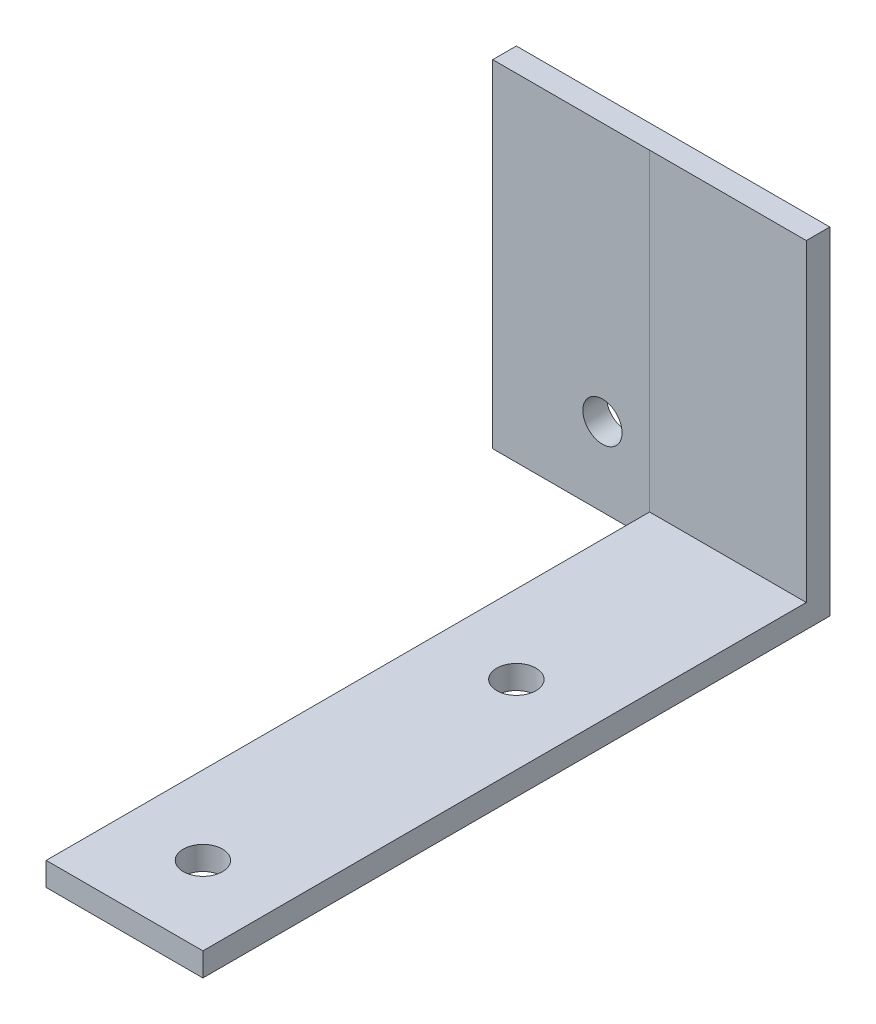
ISO-10303-21;
HEADER;
FILE_DESCRIPTION(('STEP AP214'),'2;1');
FILE_NAME('part.step','',(''),(''),'','','');
FILE_SCHEMA(('AUTOMOTIVE_DESIGN { 1 0 10303 214 1 1 1 1 }'));
ENDSEC;
DATA;
#1=APPLICATION_CONTEXT('core data for automotive mechanical design processes');
#2=APPLICATION_PROTOCOL_DEFINITION('international standard','automotive_design',2000,#1);
#3=PRODUCT_CONTEXT('',#1,'mechanical');
#4=PRODUCT('Part','Part','',(#3));
#5=PRODUCT_RELATED_PRODUCT_CATEGORY('part','',(#4));
#6=PRODUCT_DEFINITION_FORMATION('','',#4);
#7=PRODUCT_DEFINITION_CONTEXT('part definition',#1,'design');
#8=PRODUCT_DEFINITION('design','',#6,#7);
#9=PRODUCT_DEFINITION_SHAPE('','',#8);
#10=(LENGTH_UNIT() NAMED_UNIT(*) SI_UNIT(.MILLI.,.METRE.));
#11=(NAMED_UNIT(*) PLANE_ANGLE_UNIT() SI_UNIT($,.RADIAN.));
#12=(NAMED_UNIT(*) SI_UNIT($,.STERADIAN.) SOLID_ANGLE_UNIT());
#13=UNCERTAINTY_MEASURE_WITH_UNIT(LENGTH_MEASURE(1.E-05),#10,'distance_accuracy_value','');
#14=(GEOMETRIC_REPRESENTATION_CONTEXT(3) GLOBAL_UNCERTAINTY_ASSIGNED_CONTEXT((#13)) GLOBAL_UNIT_ASSIGNED_CONTEXT((#10,
#11,#12)) REPRESENTATION_CONTEXT('',''));
#15=CARTESIAN_POINT('',(0.,0.,0.));
#16=DIRECTION('',(0.,0.,1.));
#17=DIRECTION('',(1.,0.,0.));
#18=AXIS2_PLACEMENT_3D('',#15,#16,#17);
#19=CARTESIAN_POINT('',(-10.,3.,-40.));
#20=DIRECTION('',(1.,0.,0.));
#21=DIRECTION('',(0.,0.,-1.));
#22=AXIS2_PLACEMENT_3D('',#19,#20,#21);
#23=PLANE('',#22);
#24=DIRECTION('',(0.,1.,0.));
#25=VECTOR('',#24,1.);
#26=CARTESIAN_POINT('',(-10.,43.,-36.9846765094458));
#27=LINE('',#26,#25);
#28=CARTESIAN_POINT('',(-10.,0.,-36.9846765094458));
#29=VERTEX_POINT('',#28);
#30=CARTESIAN_POINT('',(-10.,3.,-36.9846765094458));
#31=VERTEX_POINT('',#30);
#32=EDGE_CURVE('E60',#29,#31,#27,.T.);
#33=ORIENTED_EDGE('',*,*,#32,.F.);
#34=DIRECTION('',(0.,0.,1.));
#35=VECTOR('',#34,1.);
#36=CARTESIAN_POINT('',(-10.,0.,-40.));
#37=LINE('',#36,#35);
#38=CARTESIAN_POINT('',(-9.99999999999999,0.,40.));
#39=VERTEX_POINT('',#38);
#40=EDGE_CURVE('E123',#29,#39,#37,.T.);
#41=ORIENTED_EDGE('',*,*,#40,.T.);
#42=DIRECTION('',(0.,-1.,0.));
#43=VECTOR('',#42,1.);
#44=CARTESIAN_POINT('',(-9.99999999999999,3.,40.));
#45=LINE('',#44,#43);
#46=CARTESIAN_POINT('',(-9.99999999999999,3.,40.));
#47=VERTEX_POINT('',#46);
#48=EDGE_CURVE('E53',#47,#39,#45,.T.);
#49=ORIENTED_EDGE('',*,*,#48,.F.);
#50=DIRECTION('',(0.,0.,1.));
#51=VECTOR('',#50,1.);
#52=CARTESIAN_POINT('',(-10.,3.,-40.));
#53=LINE('',#52,#51);
#54=EDGE_CURVE('E201',#31,#47,#53,.T.);
#55=ORIENTED_EDGE('',*,*,#54,.F.);
#56=EDGE_LOOP('',(#33,#41,#49,#55));
#57=FACE_BOUND('',#56,.T.);
#58=ADVANCED_FACE('F43',(#57),#23,.F.);
#59=CARTESIAN_POINT('',(0.,3.,0.));
#60=DIRECTION('',(0.,1.,0.));
#61=DIRECTION('',(0.,0.,1.));
#62=AXIS2_PLACEMENT_3D('',#59,#60,#61);
#63=PLANE('',#62);
#64=DIRECTION('',(1.,0.,0.));
#65=VECTOR('',#64,1.);
#66=CARTESIAN_POINT('',(-10.,3.,-37.));
#67=LINE('',#66,#65);
#68=CARTESIAN_POINT('',(-10.,3.,-37.));
#69=VERTEX_POINT('',#68);
#70=CARTESIAN_POINT('',(10.,3.,-37.));
#71=VERTEX_POINT('',#70);
#72=EDGE_CURVE('E68',#69,#71,#67,.T.);
#73=ORIENTED_EDGE('',*,*,#72,.F.);
#74=EDGE_CURVE('E203',#69,#31,#53,.T.);
#75=ORIENTED_EDGE('',*,*,#74,.T.);
#76=ORIENTED_EDGE('',*,*,#54,.T.);
#77=DIRECTION('',(1.,0.,0.));
#78=VECTOR('',#77,1.);
#79=CARTESIAN_POINT('',(-9.99999999999999,3.,40.));
#80=LINE('',#79,#78);
#81=CARTESIAN_POINT('',(10.,3.,40.));
#82=VERTEX_POINT('',#81);
#83=EDGE_CURVE('E206',#47,#82,#80,.T.);
#84=ORIENTED_EDGE('',*,*,#83,.T.);
#85=DIRECTION('',(0.,0.,-1.));
#86=VECTOR('',#85,1.);
#87=CARTESIAN_POINT('',(10.,3.,-40.));
#88=LINE('',#87,#86);
#89=EDGE_CURVE('E198',#82,#71,#88,.T.);
#90=ORIENTED_EDGE('',*,*,#89,.T.);
#91=EDGE_LOOP('',(#73,#75,#76,#84,#90));
#92=FACE_BOUND('',#91,.T.);
#93=CARTESIAN_POINT('',(0.,3.,30.));
#94=DIRECTION('',(0.,1.,0.));
#95=DIRECTION('',(0.,0.,1.));
#96=AXIS2_PLACEMENT_3D('',#93,#94,#95);
#97=CIRCLE('',#96,2.5);
#98=CARTESIAN_POINT('',(0.,3.,32.5));
#99=VERTEX_POINT('',#98);
#100=EDGE_CURVE('E191',#99,#99,#97,.T.);
#101=ORIENTED_EDGE('',*,*,#100,.F.);
#102=EDGE_LOOP('',(#101));
#103=FACE_BOUND('',#102,.T.);
#104=CARTESIAN_POINT('',(0.,3.,-10.));
#105=DIRECTION('',(0.,1.,0.));
#106=DIRECTION('',(0.,0.,1.));
#107=AXIS2_PLACEMENT_3D('',#104,#105,#106);
#108=CIRCLE('',#107,2.5);
#109=CARTESIAN_POINT('',(0.,3.,-7.5));
#110=VERTEX_POINT('',#109);
#111=EDGE_CURVE('E183',#110,#110,#108,.T.);
#112=ORIENTED_EDGE('',*,*,#111,.F.);
#113=EDGE_LOOP('',(#112));
#114=FACE_BOUND('',#113,.T.);
#115=ADVANCED_FACE('F231',(#92,#103,#114),#63,.T.);
#116=CARTESIAN_POINT('',(0.,0.,0.));
#117=DIRECTION('',(0.,1.,0.));
#118=DIRECTION('',(0.,0.,1.));
#119=AXIS2_PLACEMENT_3D('',#116,#117,#118);
#120=PLANE('',#119);
#121=DIRECTION('',(0.,0.,-1.));
#122=VECTOR('',#121,1.);
#123=CARTESIAN_POINT('',(10.,0.,-40.));
#124=LINE('',#123,#122);
#125=CARTESIAN_POINT('',(10.,0.,40.));
#126=VERTEX_POINT('',#125);
#127=CARTESIAN_POINT('',(10.,0.,-40.));
#128=VERTEX_POINT('',#127);
#129=EDGE_CURVE('E124',#126,#128,#124,.T.);
#130=ORIENTED_EDGE('',*,*,#129,.F.);
#131=DIRECTION('',(1.,0.,0.));
#132=VECTOR('',#131,1.);
#133=CARTESIAN_POINT('',(-9.99999999999999,0.,40.));
#134=LINE('',#133,#132);
#135=EDGE_CURVE('E202',#39,#126,#134,.T.);
#136=ORIENTED_EDGE('',*,*,#135,.F.);
#137=ORIENTED_EDGE('',*,*,#40,.F.);
#138=DIRECTION('',(1.,0.,0.));
#139=VECTOR('',#138,1.);
#140=CARTESIAN_POINT('',(-30.,0.,-36.9846765094458));
#141=LINE('',#140,#139);
#142=CARTESIAN_POINT('',(-30.,0.,-36.9846765094458));
#143=VERTEX_POINT('',#142);
#144=EDGE_CURVE('E131',#143,#29,#141,.T.);
#145=ORIENTED_EDGE('',*,*,#144,.F.);
#146=DIRECTION('',(0.,0.,1.));
#147=VECTOR('',#146,1.);
#148=CARTESIAN_POINT('',(-30.,0.,-40.));
#149=LINE('',#148,#147);
#150=CARTESIAN_POINT('',(-30.,0.,-40.));
#151=VERTEX_POINT('',#150);
#152=EDGE_CURVE('E127',#151,#143,#149,.T.);
#153=ORIENTED_EDGE('',*,*,#152,.F.);
#154=DIRECTION('',(-1.,0.,0.));
#155=VECTOR('',#154,1.);
#156=CARTESIAN_POINT('',(-10.,0.,-40.));
#157=LINE('',#156,#155);
#158=EDGE_CURVE('E113',#128,#151,#157,.T.);
#159=ORIENTED_EDGE('',*,*,#158,.F.);
#160=EDGE_LOOP('',(#130,#136,#137,#145,#153,#159));
#161=FACE_BOUND('',#160,.T.);
#162=CARTESIAN_POINT('',(0.,0.,30.));
#163=DIRECTION('',(0.,1.,0.));
#164=DIRECTION('',(0.,0.,1.));
#165=AXIS2_PLACEMENT_3D('',#162,#163,#164);
#166=CIRCLE('',#165,2.5);
#167=CARTESIAN_POINT('',(0.,0.,32.5));
#168=VERTEX_POINT('',#167);
#169=EDGE_CURVE('E187',#168,#168,#166,.T.);
#170=ORIENTED_EDGE('',*,*,#169,.T.);
#171=EDGE_LOOP('',(#170));
#172=FACE_BOUND('',#171,.T.);
#173=CARTESIAN_POINT('',(0.,0.,-10.));
#174=DIRECTION('',(0.,1.,0.));
#175=DIRECTION('',(0.,0.,1.));
#176=AXIS2_PLACEMENT_3D('',#173,#174,#175);
#177=CIRCLE('',#176,2.5);
#178=CARTESIAN_POINT('',(0.,0.,-7.5));
#179=VERTEX_POINT('',#178);
#180=EDGE_CURVE('E182',#179,#179,#177,.T.);
#181=ORIENTED_EDGE('',*,*,#180,.T.);
#182=EDGE_LOOP('',(#181));
#183=FACE_BOUND('',#182,.T.);
#184=ADVANCED_FACE('F128',(#161,#172,#183),#120,.F.);
#185=CARTESIAN_POINT('',(10.,3.,-40.));
#186=DIRECTION('',(-1.,0.,0.));
#187=DIRECTION('',(0.,0.,1.));
#188=AXIS2_PLACEMENT_3D('',#185,#186,#187);
#189=PLANE('',#188);
#190=ORIENTED_EDGE('',*,*,#129,.T.);
#191=DIRECTION('',(0.,-1.,0.));
#192=VECTOR('',#191,1.);
#193=CARTESIAN_POINT('',(10.,3.,-40.));
#194=LINE('',#193,#192);
#195=CARTESIAN_POINT('',(10.,43.,-40.));
#196=VERTEX_POINT('',#195);
#197=EDGE_CURVE('E11',#196,#128,#194,.T.);
#198=ORIENTED_EDGE('',*,*,#197,.F.);
#199=DIRECTION('',(0.,0.,-1.));
#200=VECTOR('',#199,1.);
#201=CARTESIAN_POINT('',(10.,43.,-40.));
#202=LINE('',#201,#200);
#203=CARTESIAN_POINT('',(10.,43.,-37.));
#204=VERTEX_POINT('',#203);
#205=EDGE_CURVE('E166',#204,#196,#202,.T.);
#206=ORIENTED_EDGE('',*,*,#205,.F.);
#207=DIRECTION('',(0.,-1.,0.));
#208=VECTOR('',#207,1.);
#209=CARTESIAN_POINT('',(10.,43.,-37.));
#210=LINE('',#209,#208);
#211=EDGE_CURVE('E173',#204,#71,#210,.T.);
#212=ORIENTED_EDGE('',*,*,#211,.T.);
#213=ORIENTED_EDGE('',*,*,#89,.F.);
#214=DIRECTION('',(0.,-1.,0.));
#215=VECTOR('',#214,1.);
#216=CARTESIAN_POINT('',(10.,3.,40.));
#217=LINE('',#216,#215);
#218=EDGE_CURVE('E209',#82,#126,#217,.T.);
#219=ORIENTED_EDGE('',*,*,#218,.T.);
#220=EDGE_LOOP('',(#190,#198,#206,#212,#213,#219));
#221=FACE_BOUND('',#220,.T.);
#222=ADVANCED_FACE('F45',(#221),#189,.F.);
#223=CARTESIAN_POINT('',(-10.,3.,-40.));
#224=DIRECTION('',(0.,0.,1.));
#225=DIRECTION('',(1.,0.,0.));
#226=AXIS2_PLACEMENT_3D('',#223,#224,#225);
#227=PLANE('',#226);
#228=CARTESIAN_POINT('',(-16.,10.,-40.));
#229=DIRECTION('',(0.,0.,-1.));
#230=DIRECTION('',(-1.,0.,0.));
#231=AXIS2_PLACEMENT_3D('',#228,#229,#230);
#232=CIRCLE('',#231,2.5);
#233=CARTESIAN_POINT('',(-18.5,10.,-40.));
#234=VERTEX_POINT('',#233);
#235=EDGE_CURVE('E148',#234,#234,#232,.T.);
#236=ORIENTED_EDGE('',*,*,#235,.F.);
#237=EDGE_LOOP('',(#236));
#238=FACE_BOUND('',#237,.T.);
#239=ORIENTED_EDGE('',*,*,#158,.T.);
#240=DIRECTION('',(0.,-1.,0.));
#241=VECTOR('',#240,1.);
#242=CARTESIAN_POINT('',(-30.,43.,-40.));
#243=LINE('',#242,#241);
#244=CARTESIAN_POINT('',(-30.,43.,-40.));
#245=VERTEX_POINT('',#244);
#246=EDGE_CURVE('E118',#245,#151,#243,.T.);
#247=ORIENTED_EDGE('',*,*,#246,.F.);
#248=DIRECTION('',(-1.,0.,0.));
#249=VECTOR('',#248,1.);
#250=CARTESIAN_POINT('',(-10.,43.,-40.));
#251=LINE('',#250,#249);
#252=EDGE_CURVE('E170',#196,#245,#251,.T.);
#253=ORIENTED_EDGE('',*,*,#252,.F.);
#254=ORIENTED_EDGE('',*,*,#197,.T.);
#255=EDGE_LOOP('',(#239,#247,#253,#254));
#256=FACE_BOUND('',#255,.T.);
#257=ADVANCED_FACE('F115',(#238,#256),#227,.F.);
#258=CARTESIAN_POINT('',(-9.99999999999999,3.,40.));
#259=DIRECTION('',(0.,0.,-1.));
#260=DIRECTION('',(-1.,0.,0.));
#261=AXIS2_PLACEMENT_3D('',#258,#259,#260);
#262=PLANE('',#261);
#263=ORIENTED_EDGE('',*,*,#135,.T.);
#264=ORIENTED_EDGE('',*,*,#218,.F.);
#265=ORIENTED_EDGE('',*,*,#83,.F.);
#266=ORIENTED_EDGE('',*,*,#48,.T.);
#267=EDGE_LOOP('',(#263,#264,#265,#266));
#268=FACE_BOUND('',#267,.T.);
#269=ADVANCED_FACE('F225',(#268),#262,.F.);
#270=CARTESIAN_POINT('',(0.,3.,30.));
#271=DIRECTION('',(0.,-1.,0.));
#272=DIRECTION('',(0.,0.,-1.));
#273=AXIS2_PLACEMENT_3D('',#270,#271,#272);
#274=CYLINDRICAL_SURFACE('',#273,2.5);
#275=ORIENTED_EDGE('',*,*,#100,.T.);
#276=EDGE_LOOP('',(#275));
#277=FACE_BOUND('',#276,.T.);
#278=ORIENTED_EDGE('',*,*,#169,.F.);
#279=EDGE_LOOP('',(#278));
#280=FACE_BOUND('',#279,.T.);
#281=ADVANCED_FACE('F256',(#277,#280),#274,.F.);
#282=CARTESIAN_POINT('',(0.,3.,-10.));
#283=DIRECTION('',(0.,-1.,0.));
#284=DIRECTION('',(0.,0.,-1.));
#285=AXIS2_PLACEMENT_3D('',#282,#283,#284);
#286=CYLINDRICAL_SURFACE('',#285,2.5);
#287=ORIENTED_EDGE('',*,*,#111,.T.);
#288=EDGE_LOOP('',(#287));
#289=FACE_BOUND('',#288,.T.);
#290=ORIENTED_EDGE('',*,*,#180,.F.);
#291=EDGE_LOOP('',(#290));
#292=FACE_BOUND('',#291,.T.);
#293=ADVANCED_FACE('F278',(#289,#292),#286,.F.);
#294=CARTESIAN_POINT('',(-10.,43.,-37.));
#295=DIRECTION('',(0.,0.,-1.));
#296=DIRECTION('',(-1.,0.,0.));
#297=AXIS2_PLACEMENT_3D('',#294,#295,#296);
#298=PLANE('',#297);
#299=ORIENTED_EDGE('',*,*,#72,.T.);
#300=ORIENTED_EDGE('',*,*,#211,.F.);
#301=DIRECTION('',(1.,0.,0.));
#302=VECTOR('',#301,1.);
#303=CARTESIAN_POINT('',(-10.,43.,-37.));
#304=LINE('',#303,#302);
#305=CARTESIAN_POINT('',(-10.,43.,-37.));
#306=VERTEX_POINT('',#305);
#307=EDGE_CURVE('E163',#306,#204,#304,.T.);
#308=ORIENTED_EDGE('',*,*,#307,.F.);
#309=DIRECTION('',(0.,-1.,0.));
#310=VECTOR('',#309,1.);
#311=CARTESIAN_POINT('',(-10.,43.,-37.));
#312=LINE('',#311,#310);
#313=EDGE_CURVE('E179',#306,#69,#312,.T.);
#314=ORIENTED_EDGE('',*,*,#313,.T.);
#315=EDGE_LOOP('',(#299,#300,#308,#314));
#316=FACE_BOUND('',#315,.T.);
#317=ADVANCED_FACE('F234',(#316),#298,.F.);
#318=CARTESIAN_POINT('',(0.,43.,0.));
#319=DIRECTION('',(0.,1.,0.));
#320=DIRECTION('',(0.,0.,1.));
#321=AXIS2_PLACEMENT_3D('',#318,#319,#320);
#322=PLANE('',#321);
#323=ORIENTED_EDGE('',*,*,#252,.T.);
#324=DIRECTION('',(0.,0.,-1.));
#325=VECTOR('',#324,1.);
#326=CARTESIAN_POINT('',(-30.,43.,-40.));
#327=LINE('',#326,#325);
#328=CARTESIAN_POINT('',(-30.,43.,-36.9846765094458));
#329=VERTEX_POINT('',#328);
#330=EDGE_CURVE('E140',#329,#245,#327,.T.);
#331=ORIENTED_EDGE('',*,*,#330,.F.);
#332=DIRECTION('',(1.,0.,0.));
#333=VECTOR('',#332,1.);
#334=CARTESIAN_POINT('',(-30.,43.,-36.9846765094458));
#335=LINE('',#334,#333);
#336=CARTESIAN_POINT('',(-10.,43.,-36.9846765094458));
#337=VERTEX_POINT('',#336);
#338=EDGE_CURVE('E154',#329,#337,#335,.T.);
#339=ORIENTED_EDGE('',*,*,#338,.T.);
#340=DIRECTION('',(0.,0.,-1.));
#341=VECTOR('',#340,1.);
#342=CARTESIAN_POINT('',(-10.,43.,-40.));
#343=LINE('',#342,#341);
#344=EDGE_CURVE('E142',#337,#306,#343,.T.);
#345=ORIENTED_EDGE('',*,*,#344,.T.);
#346=ORIENTED_EDGE('',*,*,#307,.T.);
#347=ORIENTED_EDGE('',*,*,#205,.T.);
#348=EDGE_LOOP('',(#323,#331,#339,#345,#346,#347));
#349=FACE_BOUND('',#348,.T.);
#350=ADVANCED_FACE('F270',(#349),#322,.T.);
#351=CARTESIAN_POINT('',(-30.,43.,-36.9846765094458));
#352=DIRECTION('',(0.,0.,-1.));
#353=DIRECTION('',(-1.,0.,0.));
#354=AXIS2_PLACEMENT_3D('',#351,#352,#353);
#355=PLANE('',#354);
#356=CARTESIAN_POINT('',(-16.,10.,-36.9846765094458));
#357=DIRECTION('',(0.,0.,-1.));
#358=DIRECTION('',(-1.,0.,0.));
#359=AXIS2_PLACEMENT_3D('',#356,#357,#358);
#360=CIRCLE('',#359,2.5);
#361=CARTESIAN_POINT('',(-18.5,10.,-36.9846765094458));
#362=VERTEX_POINT('',#361);
#363=EDGE_CURVE('E47',#362,#362,#360,.T.);
#364=ORIENTED_EDGE('',*,*,#363,.T.);
#365=EDGE_LOOP('',(#364));
#366=FACE_BOUND('',#365,.T.);
#367=ORIENTED_EDGE('',*,*,#32,.T.);
#368=EDGE_CURVE('E156',#31,#337,#27,.T.);
#369=ORIENTED_EDGE('',*,*,#368,.T.);
#370=ORIENTED_EDGE('',*,*,#338,.F.);
#371=DIRECTION('',(0.,1.,0.));
#372=VECTOR('',#371,1.);
#373=CARTESIAN_POINT('',(-30.,43.,-36.9846765094458));
#374=LINE('',#373,#372);
#375=EDGE_CURVE('E135',#143,#329,#374,.T.);
#376=ORIENTED_EDGE('',*,*,#375,.F.);
#377=ORIENTED_EDGE('',*,*,#144,.T.);
#378=EDGE_LOOP('',(#367,#369,#370,#376,#377));
#379=FACE_BOUND('',#378,.T.);
#380=ADVANCED_FACE('F268',(#366,#379),#355,.F.);
#381=CARTESIAN_POINT('',(-30.,0.,0.));
#382=DIRECTION('',(-1.,0.,0.));
#383=DIRECTION('',(0.,0.,1.));
#384=AXIS2_PLACEMENT_3D('',#381,#382,#383);
#385=PLANE('',#384);
#386=ORIENTED_EDGE('',*,*,#246,.T.);
#387=ORIENTED_EDGE('',*,*,#152,.T.);
#388=ORIENTED_EDGE('',*,*,#375,.T.);
#389=ORIENTED_EDGE('',*,*,#330,.T.);
#390=EDGE_LOOP('',(#386,#387,#388,#389));
#391=FACE_BOUND('',#390,.T.);
#392=ADVANCED_FACE('F138',(#391),#385,.T.);
#393=CARTESIAN_POINT('',(-9.99999999999998,0.,0.));
#394=DIRECTION('',(-1.,0.,0.));
#395=DIRECTION('',(0.,0.,1.));
#396=AXIS2_PLACEMENT_3D('',#393,#394,#395);
#397=PLANE('',#396);
#398=ORIENTED_EDGE('',*,*,#74,.F.);
#399=ORIENTED_EDGE('',*,*,#313,.F.);
#400=ORIENTED_EDGE('',*,*,#344,.F.);
#401=ORIENTED_EDGE('',*,*,#368,.F.);
#402=EDGE_LOOP('',(#398,#399,#400,#401));
#403=FACE_BOUND('',#402,.T.);
#404=ADVANCED_FACE('F240',(#403),#397,.F.);
#405=CARTESIAN_POINT('',(-16.,10.,-20.));
#406=DIRECTION('',(0.,0.,-1.));
#407=DIRECTION('',(-1.,0.,0.));
#408=AXIS2_PLACEMENT_3D('',#405,#406,#407);
#409=CYLINDRICAL_SURFACE('',#408,2.5);
#410=ORIENTED_EDGE('',*,*,#235,.T.);
#411=EDGE_LOOP('',(#410));
#412=FACE_BOUND('',#411,.T.);
#413=ORIENTED_EDGE('',*,*,#363,.F.);
#414=EDGE_LOOP('',(#413));
#415=FACE_BOUND('',#414,.T.);
#416=ADVANCED_FACE('F398',(#412,#415),#409,.F.);
#417=CLOSED_SHELL('',(#58,#115,#184,#222,#257,#269,#281,#293,#317,#350,#380,#392,#404,#416));
#418=MANIFOLD_SOLID_BREP('B2',#417);
#419=ADVANCED_BREP_SHAPE_REPRESENTATION('',(#18,#418),#14);
#420=SHAPE_DEFINITION_REPRESENTATION(#9,#419);
ENDSEC;
END-ISO-10303-21;
